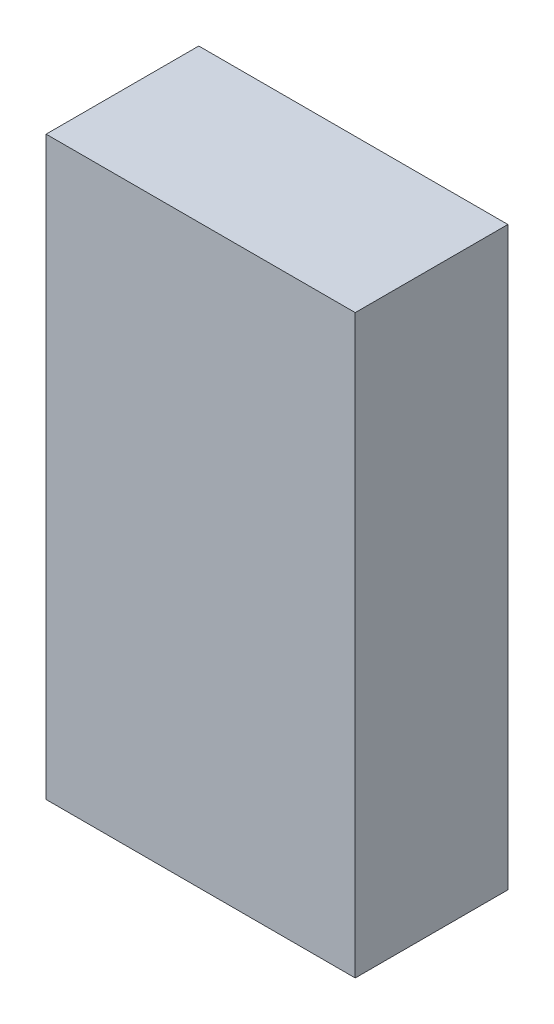
ISO-10303-21;
HEADER;
FILE_DESCRIPTION(('STEP AP214'),'2;1');
FILE_NAME('part.step','',(''),(''),'','','');
FILE_SCHEMA(('AUTOMOTIVE_DESIGN { 1 0 10303 214 1 1 1 1 }'));
ENDSEC;
DATA;
#1=APPLICATION_CONTEXT('core data for automotive mechanical design processes');
#2=APPLICATION_PROTOCOL_DEFINITION('international standard','automotive_design',2000,#1);
#3=PRODUCT_CONTEXT('',#1,'mechanical');
#4=PRODUCT('Part','Part','',(#3));
#5=PRODUCT_RELATED_PRODUCT_CATEGORY('part','',(#4));
#6=PRODUCT_DEFINITION_FORMATION('','',#4);
#7=PRODUCT_DEFINITION_CONTEXT('part definition',#1,'design');
#8=PRODUCT_DEFINITION('design','',#6,#7);
#9=PRODUCT_DEFINITION_SHAPE('','',#8);
#10=(LENGTH_UNIT() NAMED_UNIT(*) SI_UNIT(.MILLI.,.METRE.));
#11=(NAMED_UNIT(*) PLANE_ANGLE_UNIT() SI_UNIT($,.RADIAN.));
#12=(NAMED_UNIT(*) SI_UNIT($,.STERADIAN.) SOLID_ANGLE_UNIT());
#13=UNCERTAINTY_MEASURE_WITH_UNIT(LENGTH_MEASURE(1.E-05),#10,'distance_accuracy_value','');
#14=(GEOMETRIC_REPRESENTATION_CONTEXT(3) GLOBAL_UNCERTAINTY_ASSIGNED_CONTEXT((#13)) GLOBAL_UNIT_ASSIGNED_CONTEXT((#10,
#11,#12)) REPRESENTATION_CONTEXT('',''));
#15=CARTESIAN_POINT('',(0.,0.,0.));
#16=DIRECTION('',(0.,0.,1.));
#17=DIRECTION('',(1.,0.,0.));
#18=AXIS2_PLACEMENT_3D('',#15,#16,#17);
#19=CARTESIAN_POINT('',(-0.40499792,0.75499976,0.3999992));
#20=DIRECTION('',(0.,0.,1.));
#21=DIRECTION('',(1.,0.,0.));
#22=AXIS2_PLACEMENT_3D('',#19,#20,#21);
#23=PLANE('',#22);
#24=DIRECTION('',(0.,1.,0.));
#25=VECTOR('',#24,1.);
#26=CARTESIAN_POINT('',(-0.40499792,-0.75499976,0.3999992));
#27=LINE('',#26,#25);
#28=CARTESIAN_POINT('',(-0.40499792,-0.75499976,0.3999992));
#29=VERTEX_POINT('',#28);
#30=CARTESIAN_POINT('',(-0.40499792,0.75499976,0.3999992));
#31=VERTEX_POINT('',#30);
#32=EDGE_CURVE('E26',#29,#31,#27,.T.);
#33=ORIENTED_EDGE('',*,*,#32,.F.);
#34=DIRECTION('',(-1.,0.,0.));
#35=VECTOR('',#34,1.);
#36=CARTESIAN_POINT('',(0.40499792,-0.75499976,0.3999992));
#37=LINE('',#36,#35);
#38=CARTESIAN_POINT('',(0.40499792,-0.75499976,0.3999992));
#39=VERTEX_POINT('',#38);
#40=EDGE_CURVE('E58',#39,#29,#37,.T.);
#41=ORIENTED_EDGE('',*,*,#40,.F.);
#42=DIRECTION('',(0.,-1.,0.));
#43=VECTOR('',#42,1.);
#44=CARTESIAN_POINT('',(0.40499792,0.75499976,0.3999992));
#45=LINE('',#44,#43);
#46=CARTESIAN_POINT('',(0.40499792,0.75499976,0.3999992));
#47=VERTEX_POINT('',#46);
#48=EDGE_CURVE('E87',#47,#39,#45,.T.);
#49=ORIENTED_EDGE('',*,*,#48,.F.);
#50=DIRECTION('',(1.,0.,0.));
#51=VECTOR('',#50,1.);
#52=CARTESIAN_POINT('',(-0.40499792,0.75499976,0.3999992));
#53=LINE('',#52,#51);
#54=EDGE_CURVE('E85',#31,#47,#53,.T.);
#55=ORIENTED_EDGE('',*,*,#54,.F.);
#56=EDGE_LOOP('',(#33,#41,#49,#55));
#57=FACE_BOUND('',#56,.T.);
#58=ADVANCED_FACE('F17',(#57),#23,.T.);
#59=CARTESIAN_POINT('',(-0.40499792,0.75499976,0.));
#60=DIRECTION('',(0.,0.,1.));
#61=DIRECTION('',(1.,0.,0.));
#62=AXIS2_PLACEMENT_3D('',#59,#60,#61);
#63=PLANE('',#62);
#64=DIRECTION('',(1.,0.,0.));
#65=VECTOR('',#64,1.);
#66=CARTESIAN_POINT('',(-0.40499792,0.75499976,0.));
#67=LINE('',#66,#65);
#68=CARTESIAN_POINT('',(-0.40499792,0.75499976,0.));
#69=VERTEX_POINT('',#68);
#70=CARTESIAN_POINT('',(0.40499792,0.75499976,0.));
#71=VERTEX_POINT('',#70);
#72=EDGE_CURVE('E95',#69,#71,#67,.T.);
#73=ORIENTED_EDGE('',*,*,#72,.T.);
#74=DIRECTION('',(0.,-1.,0.));
#75=VECTOR('',#74,1.);
#76=CARTESIAN_POINT('',(0.40499792,0.75499976,0.));
#77=LINE('',#76,#75);
#78=CARTESIAN_POINT('',(0.40499792,-0.75499976,0.));
#79=VERTEX_POINT('',#78);
#80=EDGE_CURVE('E69',#71,#79,#77,.T.);
#81=ORIENTED_EDGE('',*,*,#80,.T.);
#82=DIRECTION('',(-1.,0.,0.));
#83=VECTOR('',#82,1.);
#84=CARTESIAN_POINT('',(0.40499792,-0.75499976,0.));
#85=LINE('',#84,#83);
#86=CARTESIAN_POINT('',(-0.40499792,-0.75499976,0.));
#87=VERTEX_POINT('',#86);
#88=EDGE_CURVE('E49',#79,#87,#85,.T.);
#89=ORIENTED_EDGE('',*,*,#88,.T.);
#90=DIRECTION('',(0.,1.,0.));
#91=VECTOR('',#90,1.);
#92=CARTESIAN_POINT('',(-0.40499792,-0.75499976,0.));
#93=LINE('',#92,#91);
#94=EDGE_CURVE('E11',#87,#69,#93,.T.);
#95=ORIENTED_EDGE('',*,*,#94,.T.);
#96=EDGE_LOOP('',(#73,#81,#89,#95));
#97=FACE_BOUND('',#96,.T.);
#98=ADVANCED_FACE('F183',(#97),#63,.F.);
#99=CARTESIAN_POINT('',(-0.40499792,-0.75499976,0.));
#100=DIRECTION('',(-1.,0.,0.));
#101=DIRECTION('',(0.,0.,1.));
#102=AXIS2_PLACEMENT_3D('',#99,#100,#101);
#103=PLANE('',#102);
#104=DIRECTION('',(0.,0.,1.));
#105=VECTOR('',#104,1.);
#106=CARTESIAN_POINT('',(-0.40499792,-0.75499976,0.));
#107=LINE('',#106,#105);
#108=EDGE_CURVE('E82',#87,#29,#107,.T.);
#109=ORIENTED_EDGE('',*,*,#108,.T.);
#110=ORIENTED_EDGE('',*,*,#32,.T.);
#111=DIRECTION('',(0.,0.,1.));
#112=VECTOR('',#111,1.);
#113=CARTESIAN_POINT('',(-0.40499792,0.75499976,0.));
#114=LINE('',#113,#112);
#115=EDGE_CURVE('E81',#69,#31,#114,.T.);
#116=ORIENTED_EDGE('',*,*,#115,.F.);
#117=ORIENTED_EDGE('',*,*,#94,.F.);
#118=EDGE_LOOP('',(#109,#110,#116,#117));
#119=FACE_BOUND('',#118,.T.);
#120=ADVANCED_FACE('F79',(#119),#103,.T.);
#121=CARTESIAN_POINT('',(0.40499792,-0.75499976,0.));
#122=DIRECTION('',(0.,-1.,0.));
#123=DIRECTION('',(0.,0.,-1.));
#124=AXIS2_PLACEMENT_3D('',#121,#122,#123);
#125=PLANE('',#124);
#126=DIRECTION('',(0.,0.,1.));
#127=VECTOR('',#126,1.);
#128=CARTESIAN_POINT('',(0.40499792,-0.75499976,0.));
#129=LINE('',#128,#127);
#130=EDGE_CURVE('E105',#79,#39,#129,.T.);
#131=ORIENTED_EDGE('',*,*,#130,.T.);
#132=ORIENTED_EDGE('',*,*,#40,.T.);
#133=ORIENTED_EDGE('',*,*,#108,.F.);
#134=ORIENTED_EDGE('',*,*,#88,.F.);
#135=EDGE_LOOP('',(#131,#132,#133,#134));
#136=FACE_BOUND('',#135,.T.);
#137=ADVANCED_FACE('F119',(#136),#125,.T.);
#138=CARTESIAN_POINT('',(0.40499792,0.75499976,0.));
#139=DIRECTION('',(1.,0.,0.));
#140=DIRECTION('',(0.,1.,0.));
#141=AXIS2_PLACEMENT_3D('',#138,#139,#140);
#142=PLANE('',#141);
#143=DIRECTION('',(0.,0.,1.));
#144=VECTOR('',#143,1.);
#145=CARTESIAN_POINT('',(0.40499792,0.75499976,0.));
#146=LINE('',#145,#144);
#147=EDGE_CURVE('E91',#71,#47,#146,.T.);
#148=ORIENTED_EDGE('',*,*,#147,.T.);
#149=ORIENTED_EDGE('',*,*,#48,.T.);
#150=ORIENTED_EDGE('',*,*,#130,.F.);
#151=ORIENTED_EDGE('',*,*,#80,.F.);
#152=EDGE_LOOP('',(#148,#149,#150,#151));
#153=FACE_BOUND('',#152,.T.);
#154=ADVANCED_FACE('F120',(#153),#142,.T.);
#155=CARTESIAN_POINT('',(-0.40499792,0.75499976,0.));
#156=DIRECTION('',(0.,1.,0.));
#157=DIRECTION('',(1.,0.,0.));
#158=AXIS2_PLACEMENT_3D('',#155,#156,#157);
#159=PLANE('',#158);
#160=ORIENTED_EDGE('',*,*,#115,.T.);
#161=ORIENTED_EDGE('',*,*,#54,.T.);
#162=ORIENTED_EDGE('',*,*,#147,.F.);
#163=ORIENTED_EDGE('',*,*,#72,.F.);
#164=EDGE_LOOP('',(#160,#161,#162,#163));
#165=FACE_BOUND('',#164,.T.);
#166=ADVANCED_FACE('F94',(#165),#159,.T.);
#167=CLOSED_SHELL('',(#58,#98,#120,#137,#154,#166));
#168=MANIFOLD_SOLID_BREP('B1',#167);
#169=ADVANCED_BREP_SHAPE_REPRESENTATION('',(#18,#168),#14);
#170=SHAPE_DEFINITION_REPRESENTATION(#9,#169);
ENDSEC;
END-ISO-10303-21;
